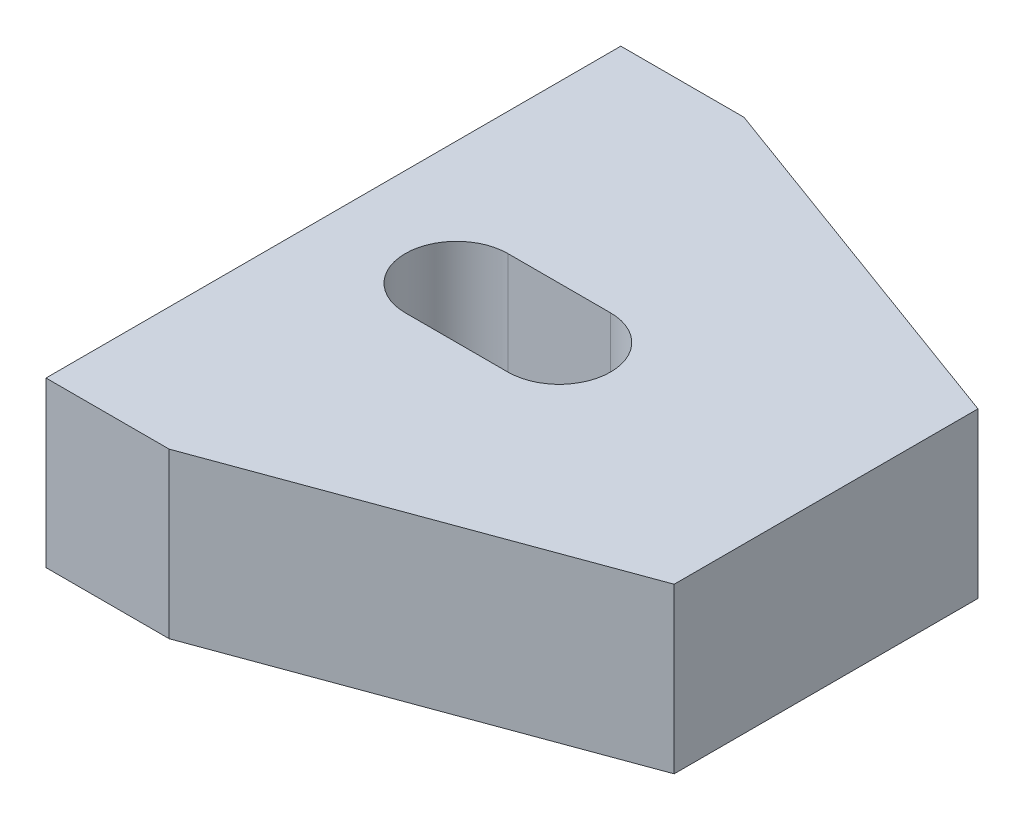
ISO-10303-21;
HEADER;
FILE_DESCRIPTION(('STEP AP214'),'2;1');
FILE_NAME('part.step','',(''),(''),'','','');
FILE_SCHEMA(('AUTOMOTIVE_DESIGN { 1 0 10303 214 1 1 1 1 }'));
ENDSEC;
DATA;
#1=APPLICATION_CONTEXT('core data for automotive mechanical design processes');
#2=APPLICATION_PROTOCOL_DEFINITION('international standard','automotive_design',2000,#1);
#3=PRODUCT_CONTEXT('',#1,'mechanical');
#4=PRODUCT('Part','Part','',(#3));
#5=PRODUCT_RELATED_PRODUCT_CATEGORY('part','',(#4));
#6=PRODUCT_DEFINITION_FORMATION('','',#4);
#7=PRODUCT_DEFINITION_CONTEXT('part definition',#1,'design');
#8=PRODUCT_DEFINITION('design','',#6,#7);
#9=PRODUCT_DEFINITION_SHAPE('','',#8);
#10=(LENGTH_UNIT() NAMED_UNIT(*) SI_UNIT(.MILLI.,.METRE.));
#11=(NAMED_UNIT(*) PLANE_ANGLE_UNIT() SI_UNIT($,.RADIAN.));
#12=(NAMED_UNIT(*) SI_UNIT($,.STERADIAN.) SOLID_ANGLE_UNIT());
#13=UNCERTAINTY_MEASURE_WITH_UNIT(LENGTH_MEASURE(1.E-05),#10,'distance_accuracy_value','');
#14=(GEOMETRIC_REPRESENTATION_CONTEXT(3) GLOBAL_UNCERTAINTY_ASSIGNED_CONTEXT((#13)) GLOBAL_UNIT_ASSIGNED_CONTEXT((#10,
#11,#12)) REPRESENTATION_CONTEXT('',''));
#15=CARTESIAN_POINT('',(0.,0.,0.));
#16=DIRECTION('',(0.,0.,1.));
#17=DIRECTION('',(1.,0.,0.));
#18=AXIS2_PLACEMENT_3D('',#15,#16,#17);
#19=CARTESIAN_POINT('',(0.,5.08,0.));
#20=DIRECTION('',(0.,1.,0.));
#21=DIRECTION('',(0.,0.,1.));
#22=AXIS2_PLACEMENT_3D('',#19,#20,#21);
#23=PLANE('',#22);
#24=DIRECTION('',(-1.,0.,0.));
#25=VECTOR('',#24,1.);
#26=CARTESIAN_POINT('',(-11.43,5.08,-8.89));
#27=LINE('',#26,#25);
#28=CARTESIAN_POINT('',(-11.43,5.08,-8.89));
#29=VERTEX_POINT('',#28);
#30=CARTESIAN_POINT('',(-15.24,5.08,-8.89));
#31=VERTEX_POINT('',#30);
#32=EDGE_CURVE('E145',#29,#31,#27,.T.);
#33=ORIENTED_EDGE('',*,*,#32,.T.);
#34=DIRECTION('',(0.,0.,1.));
#35=VECTOR('',#34,1.);
#36=CARTESIAN_POINT('',(-15.24,5.08,-8.89));
#37=LINE('',#36,#35);
#38=CARTESIAN_POINT('',(-15.24,5.08,8.89));
#39=VERTEX_POINT('',#38);
#40=EDGE_CURVE('E148',#31,#39,#37,.T.);
#41=ORIENTED_EDGE('',*,*,#40,.T.);
#42=DIRECTION('',(1.,0.,0.));
#43=VECTOR('',#42,1.);
#44=CARTESIAN_POINT('',(-15.24,5.08,8.89));
#45=LINE('',#44,#43);
#46=CARTESIAN_POINT('',(-11.43,5.08,8.89));
#47=VERTEX_POINT('',#46);
#48=EDGE_CURVE('E151',#39,#47,#45,.T.);
#49=ORIENTED_EDGE('',*,*,#48,.T.);
#50=DIRECTION('',(0.938876315886609,0.,-0.344254649158423));
#51=VECTOR('',#50,1.);
#52=CARTESIAN_POINT('',(-11.43,5.08,8.89));
#53=LINE('',#52,#51);
#54=CARTESIAN_POINT('',(0.,5.08,4.699));
#55=VERTEX_POINT('',#54);
#56=EDGE_CURVE('E153',#47,#55,#53,.T.);
#57=ORIENTED_EDGE('',*,*,#56,.T.);
#58=DIRECTION('',(0.,0.,-1.));
#59=VECTOR('',#58,1.);
#60=CARTESIAN_POINT('',(0.,5.08,4.699));
#61=LINE('',#60,#59);
#62=CARTESIAN_POINT('',(0.,5.08,-4.699));
#63=VERTEX_POINT('',#62);
#64=EDGE_CURVE('E155',#55,#63,#61,.T.);
#65=ORIENTED_EDGE('',*,*,#64,.T.);
#66=DIRECTION('',(-0.938876315886609,0.,-0.344254649158423));
#67=VECTOR('',#66,1.);
#68=CARTESIAN_POINT('',(0.,5.08,-4.699));
#69=LINE('',#68,#67);
#70=EDGE_CURVE('E157',#63,#29,#69,.T.);
#71=ORIENTED_EDGE('',*,*,#70,.T.);
#72=EDGE_LOOP('',(#33,#41,#49,#57,#65,#71));
#73=FACE_BOUND('',#72,.T.);
#74=DIRECTION('',(1.,0.,0.));
#75=VECTOR('',#74,1.);
#76=CARTESIAN_POINT('',(-11.43,5.08,1.5875));
#77=LINE('',#76,#75);
#78=CARTESIAN_POINT('',(-11.43,5.08,1.5875));
#79=VERTEX_POINT('',#78);
#80=CARTESIAN_POINT('',(-8.255,5.08,1.5875));
#81=VERTEX_POINT('',#80);
#82=EDGE_CURVE('E117',#79,#81,#77,.T.);
#83=ORIENTED_EDGE('',*,*,#82,.F.);
#84=CARTESIAN_POINT('',(-11.43,5.08,0.));
#85=DIRECTION('',(0.,1.,0.));
#86=DIRECTION('',(0.,0.,1.));
#87=AXIS2_PLACEMENT_3D('',#84,#85,#86);
#88=CIRCLE('',#87,1.5875);
#89=CARTESIAN_POINT('',(-11.43,5.08,-1.5875));
#90=VERTEX_POINT('',#89);
#91=EDGE_CURVE('E109',#90,#79,#88,.T.);
#92=ORIENTED_EDGE('',*,*,#91,.F.);
#93=DIRECTION('',(-1.,0.,0.));
#94=VECTOR('',#93,1.);
#95=CARTESIAN_POINT('',(-11.43,5.08,-1.5875));
#96=LINE('',#95,#94);
#97=CARTESIAN_POINT('',(-8.255,5.08,-1.5875));
#98=VERTEX_POINT('',#97);
#99=EDGE_CURVE('E131',#98,#90,#96,.T.);
#100=ORIENTED_EDGE('',*,*,#99,.F.);
#101=CARTESIAN_POINT('',(-8.255,5.08,0.));
#102=DIRECTION('',(0.,1.,0.));
#103=DIRECTION('',(0.,0.,1.));
#104=AXIS2_PLACEMENT_3D('',#101,#102,#103);
#105=CIRCLE('',#104,1.5875);
#106=EDGE_CURVE('E129',#81,#98,#105,.T.);
#107=ORIENTED_EDGE('',*,*,#106,.F.);
#108=EDGE_LOOP('',(#83,#92,#100,#107));
#109=FACE_BOUND('',#108,.T.);
#110=ADVANCED_FACE('F32',(#73,#109),#23,.T.);
#111=CARTESIAN_POINT('',(0.,0.,0.));
#112=DIRECTION('',(0.,1.,0.));
#113=DIRECTION('',(0.,0.,1.));
#114=AXIS2_PLACEMENT_3D('',#111,#112,#113);
#115=PLANE('',#114);
#116=DIRECTION('',(-1.,0.,0.));
#117=VECTOR('',#116,1.);
#118=CARTESIAN_POINT('',(-11.43,0.,-8.89));
#119=LINE('',#118,#117);
#120=CARTESIAN_POINT('',(-11.43,0.,-8.89));
#121=VERTEX_POINT('',#120);
#122=CARTESIAN_POINT('',(-15.24,0.,-8.89));
#123=VERTEX_POINT('',#122);
#124=EDGE_CURVE('E125',#121,#123,#119,.T.);
#125=ORIENTED_EDGE('',*,*,#124,.F.);
#126=DIRECTION('',(-0.938876315886609,0.,-0.344254649158423));
#127=VECTOR('',#126,1.);
#128=CARTESIAN_POINT('',(0.,0.,-4.699));
#129=LINE('',#128,#127);
#130=CARTESIAN_POINT('',(0.,0.,-4.699));
#131=VERTEX_POINT('',#130);
#132=EDGE_CURVE('E149',#131,#121,#129,.T.);
#133=ORIENTED_EDGE('',*,*,#132,.F.);
#134=DIRECTION('',(0.,0.,-1.));
#135=VECTOR('',#134,1.);
#136=CARTESIAN_POINT('',(0.,0.,4.699));
#137=LINE('',#136,#135);
#138=CARTESIAN_POINT('',(0.,0.,4.699));
#139=VERTEX_POINT('',#138);
#140=EDGE_CURVE('E168',#139,#131,#137,.T.);
#141=ORIENTED_EDGE('',*,*,#140,.F.);
#142=DIRECTION('',(0.938876315886609,0.,-0.344254649158423));
#143=VECTOR('',#142,1.);
#144=CARTESIAN_POINT('',(-11.43,0.,8.89));
#145=LINE('',#144,#143);
#146=CARTESIAN_POINT('',(-11.43,0.,8.89));
#147=VERTEX_POINT('',#146);
#148=EDGE_CURVE('E166',#147,#139,#145,.T.);
#149=ORIENTED_EDGE('',*,*,#148,.F.);
#150=DIRECTION('',(1.,0.,0.));
#151=VECTOR('',#150,1.);
#152=CARTESIAN_POINT('',(-15.24,0.,8.89));
#153=LINE('',#152,#151);
#154=CARTESIAN_POINT('',(-15.24,0.,8.89));
#155=VERTEX_POINT('',#154);
#156=EDGE_CURVE('E164',#155,#147,#153,.T.);
#157=ORIENTED_EDGE('',*,*,#156,.F.);
#158=DIRECTION('',(0.,0.,1.));
#159=VECTOR('',#158,1.);
#160=CARTESIAN_POINT('',(-15.24,0.,-8.89));
#161=LINE('',#160,#159);
#162=EDGE_CURVE('E162',#123,#155,#161,.T.);
#163=ORIENTED_EDGE('',*,*,#162,.F.);
#164=EDGE_LOOP('',(#125,#133,#141,#149,#157,#163));
#165=FACE_BOUND('',#164,.T.);
#166=CARTESIAN_POINT('',(-11.43,0.,0.));
#167=DIRECTION('',(0.,1.,0.));
#168=DIRECTION('',(0.,0.,1.));
#169=AXIS2_PLACEMENT_3D('',#166,#167,#168);
#170=CIRCLE('',#169,1.5875);
#171=CARTESIAN_POINT('',(-11.43,0.,-1.5875));
#172=VERTEX_POINT('',#171);
#173=CARTESIAN_POINT('',(-11.43,0.,1.5875));
#174=VERTEX_POINT('',#173);
#175=EDGE_CURVE('E55',#172,#174,#170,.T.);
#176=ORIENTED_EDGE('',*,*,#175,.T.);
#177=DIRECTION('',(1.,0.,0.));
#178=VECTOR('',#177,1.);
#179=CARTESIAN_POINT('',(-11.43,0.,1.5875));
#180=LINE('',#179,#178);
#181=CARTESIAN_POINT('',(-8.255,0.,1.5875));
#182=VERTEX_POINT('',#181);
#183=EDGE_CURVE('E124',#174,#182,#180,.T.);
#184=ORIENTED_EDGE('',*,*,#183,.T.);
#185=CARTESIAN_POINT('',(-8.255,0.,0.));
#186=DIRECTION('',(0.,1.,0.));
#187=DIRECTION('',(0.,0.,1.));
#188=AXIS2_PLACEMENT_3D('',#185,#186,#187);
#189=CIRCLE('',#188,1.5875);
#190=CARTESIAN_POINT('',(-8.255,0.,-1.5875));
#191=VERTEX_POINT('',#190);
#192=EDGE_CURVE('E137',#182,#191,#189,.T.);
#193=ORIENTED_EDGE('',*,*,#192,.T.);
#194=DIRECTION('',(-1.,0.,0.));
#195=VECTOR('',#194,1.);
#196=CARTESIAN_POINT('',(-11.43,0.,-1.5875));
#197=LINE('',#196,#195);
#198=EDGE_CURVE('E118',#191,#172,#197,.T.);
#199=ORIENTED_EDGE('',*,*,#198,.T.);
#200=EDGE_LOOP('',(#176,#184,#193,#199));
#201=FACE_BOUND('',#200,.T.);
#202=ADVANCED_FACE('F192',(#165,#201),#115,.F.);
#203=CARTESIAN_POINT('',(-11.43,5.08,-8.89));
#204=DIRECTION('',(0.,0.,1.));
#205=DIRECTION('',(1.,0.,0.));
#206=AXIS2_PLACEMENT_3D('',#203,#204,#205);
#207=PLANE('',#206);
#208=ORIENTED_EDGE('',*,*,#124,.T.);
#209=DIRECTION('',(0.,-1.,0.));
#210=VECTOR('',#209,1.);
#211=CARTESIAN_POINT('',(-15.24,5.08,-8.89));
#212=LINE('',#211,#210);
#213=EDGE_CURVE('E11',#31,#123,#212,.T.);
#214=ORIENTED_EDGE('',*,*,#213,.F.);
#215=ORIENTED_EDGE('',*,*,#32,.F.);
#216=DIRECTION('',(0.,-1.,0.));
#217=VECTOR('',#216,1.);
#218=CARTESIAN_POINT('',(-11.43,5.08,-8.89));
#219=LINE('',#218,#217);
#220=EDGE_CURVE('E159',#29,#121,#219,.T.);
#221=ORIENTED_EDGE('',*,*,#220,.T.);
#222=EDGE_LOOP('',(#208,#214,#215,#221));
#223=FACE_BOUND('',#222,.T.);
#224=ADVANCED_FACE('F34',(#223),#207,.F.);
#225=CARTESIAN_POINT('',(-15.24,5.08,-8.89));
#226=DIRECTION('',(1.,0.,0.));
#227=DIRECTION('',(0.,0.,-1.));
#228=AXIS2_PLACEMENT_3D('',#225,#226,#227);
#229=PLANE('',#228);
#230=ORIENTED_EDGE('',*,*,#162,.T.);
#231=DIRECTION('',(0.,-1.,0.));
#232=VECTOR('',#231,1.);
#233=CARTESIAN_POINT('',(-15.24,5.08,8.89));
#234=LINE('',#233,#232);
#235=EDGE_CURVE('E40',#39,#155,#234,.T.);
#236=ORIENTED_EDGE('',*,*,#235,.F.);
#237=ORIENTED_EDGE('',*,*,#40,.F.);
#238=ORIENTED_EDGE('',*,*,#213,.T.);
#239=EDGE_LOOP('',(#230,#236,#237,#238));
#240=FACE_BOUND('',#239,.T.);
#241=ADVANCED_FACE('F209',(#240),#229,.F.);
#242=CARTESIAN_POINT('',(-15.24,5.08,8.89));
#243=DIRECTION('',(0.,0.,-1.));
#244=DIRECTION('',(-1.,0.,0.));
#245=AXIS2_PLACEMENT_3D('',#242,#243,#244);
#246=PLANE('',#245);
#247=ORIENTED_EDGE('',*,*,#156,.T.);
#248=DIRECTION('',(0.,-1.,0.));
#249=VECTOR('',#248,1.);
#250=CARTESIAN_POINT('',(-11.43,5.08,8.89));
#251=LINE('',#250,#249);
#252=EDGE_CURVE('E179',#47,#147,#251,.T.);
#253=ORIENTED_EDGE('',*,*,#252,.F.);
#254=ORIENTED_EDGE('',*,*,#48,.F.);
#255=ORIENTED_EDGE('',*,*,#235,.T.);
#256=EDGE_LOOP('',(#247,#253,#254,#255));
#257=FACE_BOUND('',#256,.T.);
#258=ADVANCED_FACE('F186',(#257),#246,.F.);
#259=CARTESIAN_POINT('',(-11.43,5.08,8.89));
#260=DIRECTION('',(-0.344254649158423,0.,-0.938876315886609));
#261=DIRECTION('',(-0.938876315886609,0.,0.344254649158423));
#262=AXIS2_PLACEMENT_3D('',#259,#260,#261);
#263=PLANE('',#262);
#264=ORIENTED_EDGE('',*,*,#148,.T.);
#265=DIRECTION('',(0.,-1.,0.));
#266=VECTOR('',#265,1.);
#267=CARTESIAN_POINT('',(0.,5.08,4.699));
#268=LINE('',#267,#266);
#269=EDGE_CURVE('E176',#55,#139,#268,.T.);
#270=ORIENTED_EDGE('',*,*,#269,.F.);
#271=ORIENTED_EDGE('',*,*,#56,.F.);
#272=ORIENTED_EDGE('',*,*,#252,.T.);
#273=EDGE_LOOP('',(#264,#270,#271,#272));
#274=FACE_BOUND('',#273,.T.);
#275=ADVANCED_FACE('F198',(#274),#263,.F.);
#276=CARTESIAN_POINT('',(0.,5.08,4.699));
#277=DIRECTION('',(-1.,0.,0.));
#278=DIRECTION('',(0.,0.,1.));
#279=AXIS2_PLACEMENT_3D('',#276,#277,#278);
#280=PLANE('',#279);
#281=ORIENTED_EDGE('',*,*,#140,.T.);
#282=DIRECTION('',(0.,-1.,0.));
#283=VECTOR('',#282,1.);
#284=CARTESIAN_POINT('',(0.,5.08,-4.699));
#285=LINE('',#284,#283);
#286=EDGE_CURVE('E173',#63,#131,#285,.T.);
#287=ORIENTED_EDGE('',*,*,#286,.F.);
#288=ORIENTED_EDGE('',*,*,#64,.F.);
#289=ORIENTED_EDGE('',*,*,#269,.T.);
#290=EDGE_LOOP('',(#281,#287,#288,#289));
#291=FACE_BOUND('',#290,.T.);
#292=ADVANCED_FACE('F202',(#291),#280,.F.);
#293=CARTESIAN_POINT('',(0.,5.08,-4.699));
#294=DIRECTION('',(-0.344254649158423,0.,0.938876315886609));
#295=DIRECTION('',(0.938876315886609,0.,0.344254649158423));
#296=AXIS2_PLACEMENT_3D('',#293,#294,#295);
#297=PLANE('',#296);
#298=ORIENTED_EDGE('',*,*,#132,.T.);
#299=ORIENTED_EDGE('',*,*,#220,.F.);
#300=ORIENTED_EDGE('',*,*,#70,.F.);
#301=ORIENTED_EDGE('',*,*,#286,.T.);
#302=EDGE_LOOP('',(#298,#299,#300,#301));
#303=FACE_BOUND('',#302,.T.);
#304=ADVANCED_FACE('F212',(#303),#297,.F.);
#305=CARTESIAN_POINT('',(-11.43,5.08,0.));
#306=DIRECTION('',(0.,-1.,0.));
#307=DIRECTION('',(0.,0.,-1.));
#308=AXIS2_PLACEMENT_3D('',#305,#306,#307);
#309=CYLINDRICAL_SURFACE('',#308,1.5875);
#310=ORIENTED_EDGE('',*,*,#175,.F.);
#311=DIRECTION('',(0.,-1.,0.));
#312=VECTOR('',#311,1.);
#313=CARTESIAN_POINT('',(-11.43,5.08,-1.5875));
#314=LINE('',#313,#312);
#315=EDGE_CURVE('E113',#90,#172,#314,.T.);
#316=ORIENTED_EDGE('',*,*,#315,.F.);
#317=ORIENTED_EDGE('',*,*,#91,.T.);
#318=DIRECTION('',(0.,-1.,0.));
#319=VECTOR('',#318,1.);
#320=CARTESIAN_POINT('',(-11.43,5.08,1.5875));
#321=LINE('',#320,#319);
#322=EDGE_CURVE('E112',#79,#174,#321,.T.);
#323=ORIENTED_EDGE('',*,*,#322,.T.);
#324=EDGE_LOOP('',(#310,#316,#317,#323));
#325=FACE_BOUND('',#324,.T.);
#326=ADVANCED_FACE('F111',(#325),#309,.F.);
#327=CARTESIAN_POINT('',(-11.43,5.08,1.5875));
#328=DIRECTION('',(0.,0.,-1.));
#329=DIRECTION('',(-1.,0.,0.));
#330=AXIS2_PLACEMENT_3D('',#327,#328,#329);
#331=PLANE('',#330);
#332=ORIENTED_EDGE('',*,*,#183,.F.);
#333=ORIENTED_EDGE('',*,*,#322,.F.);
#334=ORIENTED_EDGE('',*,*,#82,.T.);
#335=DIRECTION('',(0.,-1.,0.));
#336=VECTOR('',#335,1.);
#337=CARTESIAN_POINT('',(-8.255,5.08,1.5875));
#338=LINE('',#337,#336);
#339=EDGE_CURVE('E126',#81,#182,#338,.T.);
#340=ORIENTED_EDGE('',*,*,#339,.T.);
#341=EDGE_LOOP('',(#332,#333,#334,#340));
#342=FACE_BOUND('',#341,.T.);
#343=ADVANCED_FACE('F121',(#342),#331,.T.);
#344=CARTESIAN_POINT('',(-8.255,5.08,0.));
#345=DIRECTION('',(0.,-1.,0.));
#346=DIRECTION('',(0.,0.,-1.));
#347=AXIS2_PLACEMENT_3D('',#344,#345,#346);
#348=CYLINDRICAL_SURFACE('',#347,1.5875);
#349=ORIENTED_EDGE('',*,*,#192,.F.);
#350=ORIENTED_EDGE('',*,*,#339,.F.);
#351=ORIENTED_EDGE('',*,*,#106,.T.);
#352=DIRECTION('',(0.,-1.,0.));
#353=VECTOR('',#352,1.);
#354=CARTESIAN_POINT('',(-8.255,5.08,-1.5875));
#355=LINE('',#354,#353);
#356=EDGE_CURVE('E47',#98,#191,#355,.T.);
#357=ORIENTED_EDGE('',*,*,#356,.T.);
#358=EDGE_LOOP('',(#349,#350,#351,#357));
#359=FACE_BOUND('',#358,.T.);
#360=ADVANCED_FACE('F230',(#359),#348,.F.);
#361=CARTESIAN_POINT('',(-11.43,5.08,-1.5875));
#362=DIRECTION('',(0.,0.,1.));
#363=DIRECTION('',(1.,0.,0.));
#364=AXIS2_PLACEMENT_3D('',#361,#362,#363);
#365=PLANE('',#364);
#366=ORIENTED_EDGE('',*,*,#198,.F.);
#367=ORIENTED_EDGE('',*,*,#356,.F.);
#368=ORIENTED_EDGE('',*,*,#99,.T.);
#369=ORIENTED_EDGE('',*,*,#315,.T.);
#370=EDGE_LOOP('',(#366,#367,#368,#369));
#371=FACE_BOUND('',#370,.T.);
#372=ADVANCED_FACE('F233',(#371),#365,.T.);
#373=CLOSED_SHELL('',(#110,#202,#224,#241,#258,#275,#292,#304,#326,#343,#360,#372));
#374=MANIFOLD_SOLID_BREP('B2',#373);
#375=ADVANCED_BREP_SHAPE_REPRESENTATION('',(#18,#374),#14);
#376=SHAPE_DEFINITION_REPRESENTATION(#9,#375);
ENDSEC;
END-ISO-10303-21;
